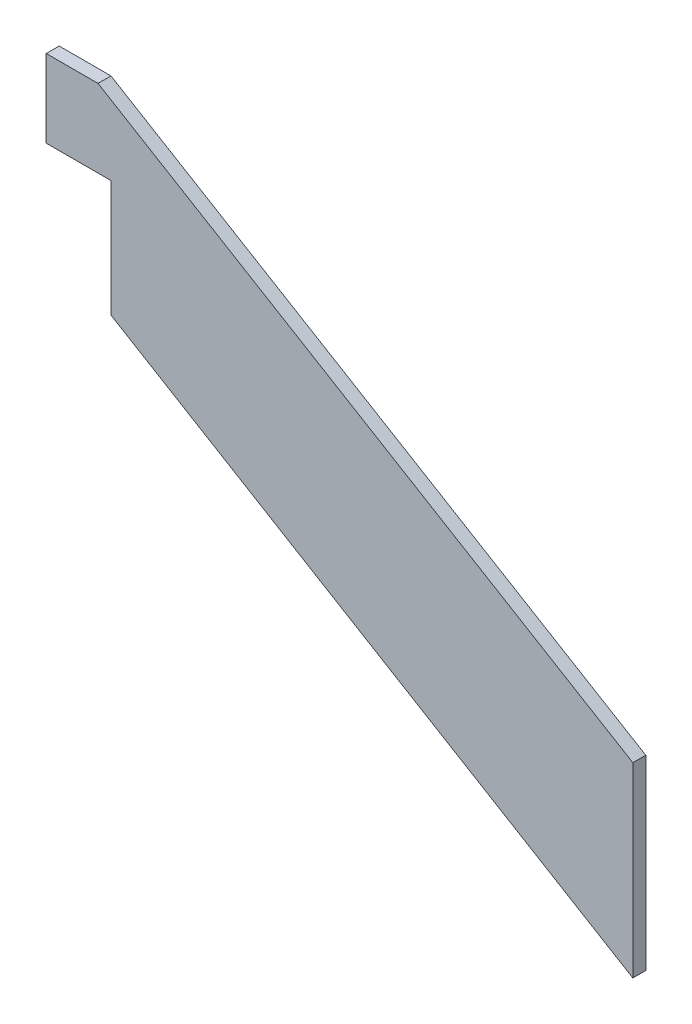
ISO-10303-21;
HEADER;
FILE_DESCRIPTION(('STEP AP214'),'2;1');
FILE_NAME('part.step','',(''),(''),'','','');
FILE_SCHEMA(('AUTOMOTIVE_DESIGN { 1 0 10303 214 1 1 1 1 }'));
ENDSEC;
DATA;
#1=APPLICATION_CONTEXT('core data for automotive mechanical design processes');
#2=APPLICATION_PROTOCOL_DEFINITION('international standard','automotive_design',2000,#1);
#3=PRODUCT_CONTEXT('',#1,'mechanical');
#4=PRODUCT('Part','Part','',(#3));
#5=PRODUCT_RELATED_PRODUCT_CATEGORY('part','',(#4));
#6=PRODUCT_DEFINITION_FORMATION('','',#4);
#7=PRODUCT_DEFINITION_CONTEXT('part definition',#1,'design');
#8=PRODUCT_DEFINITION('design','',#6,#7);
#9=PRODUCT_DEFINITION_SHAPE('','',#8);
#10=(LENGTH_UNIT() NAMED_UNIT(*) SI_UNIT(.MILLI.,.METRE.));
#11=(NAMED_UNIT(*) PLANE_ANGLE_UNIT() SI_UNIT($,.RADIAN.));
#12=(NAMED_UNIT(*) SI_UNIT($,.STERADIAN.) SOLID_ANGLE_UNIT());
#13=UNCERTAINTY_MEASURE_WITH_UNIT(LENGTH_MEASURE(1.E-05),#10,'distance_accuracy_value','');
#14=(GEOMETRIC_REPRESENTATION_CONTEXT(3) GLOBAL_UNCERTAINTY_ASSIGNED_CONTEXT((#13)) GLOBAL_UNIT_ASSIGNED_CONTEXT((#10,
#11,#12)) REPRESENTATION_CONTEXT('',''));
#15=CARTESIAN_POINT('',(0.,0.,0.));
#16=DIRECTION('',(0.,0.,1.));
#17=DIRECTION('',(1.,0.,0.));
#18=AXIS2_PLACEMENT_3D('',#15,#16,#17);
#19=CARTESIAN_POINT('',(0.,14.4,1.));
#20=DIRECTION('',(-1.,0.,0.));
#21=DIRECTION('',(0.,0.,1.));
#22=AXIS2_PLACEMENT_3D('',#19,#20,#21);
#23=PLANE('',#22);
#24=DIRECTION('',(0.,1.,0.));
#25=VECTOR('',#24,1.);
#26=CARTESIAN_POINT('',(0.,14.4,0.));
#27=LINE('',#26,#25);
#28=CARTESIAN_POINT('',(0.,0.,0.));
#29=VERTEX_POINT('',#28);
#30=CARTESIAN_POINT('',(0.,14.4,0.));
#31=VERTEX_POINT('',#30);
#32=EDGE_CURVE('E125',#29,#31,#27,.T.);
#33=ORIENTED_EDGE('',*,*,#32,.T.);
#34=DIRECTION('',(0.,0.,-1.));
#35=VECTOR('',#34,1.);
#36=CARTESIAN_POINT('',(0.,14.4,1.));
#37=LINE('',#36,#35);
#38=CARTESIAN_POINT('',(0.,14.4,1.));
#39=VERTEX_POINT('',#38);
#40=EDGE_CURVE('E11',#39,#31,#37,.T.);
#41=ORIENTED_EDGE('',*,*,#40,.F.);
#42=DIRECTION('',(0.,1.,0.));
#43=VECTOR('',#42,1.);
#44=CARTESIAN_POINT('',(0.,14.4,1.));
#45=LINE('',#44,#43);
#46=CARTESIAN_POINT('',(0.,0.,1.));
#47=VERTEX_POINT('',#46);
#48=EDGE_CURVE('E137',#47,#39,#45,.T.);
#49=ORIENTED_EDGE('',*,*,#48,.F.);
#50=DIRECTION('',(0.,0.,-1.));
#51=VECTOR('',#50,1.);
#52=CARTESIAN_POINT('',(0.,0.,1.));
#53=LINE('',#52,#51);
#54=EDGE_CURVE('E121',#47,#29,#53,.T.);
#55=ORIENTED_EDGE('',*,*,#54,.T.);
#56=EDGE_LOOP('',(#33,#41,#49,#55));
#57=FACE_BOUND('',#56,.T.);
#58=ADVANCED_FACE('F35',(#57),#23,.F.);
#59=CARTESIAN_POINT('',(-41.3021675084895,39.1813005050939,1.));
#60=DIRECTION('',(-0.51449575542753,-0.857492925712542,0.));
#61=DIRECTION('',(0.857492925712542,-0.51449575542753,0.));
#62=AXIS2_PLACEMENT_3D('',#59,#60,#61);
#63=PLANE('',#62);
#64=DIRECTION('',(-0.857492925712542,0.51449575542753,0.));
#65=VECTOR('',#64,1.);
#66=CARTESIAN_POINT('',(-41.3021675084895,39.1813005050939,0.));
#67=LINE('',#66,#65);
#68=CARTESIAN_POINT('',(-41.3021675084895,39.1813005050939,0.));
#69=VERTEX_POINT('',#68);
#70=EDGE_CURVE('E128',#31,#69,#67,.T.);
#71=ORIENTED_EDGE('',*,*,#70,.T.);
#72=DIRECTION('',(0.,0.,-1.));
#73=VECTOR('',#72,1.);
#74=CARTESIAN_POINT('',(-41.3021675084895,39.1813005050939,1.));
#75=LINE('',#74,#73);
#76=CARTESIAN_POINT('',(-41.3021675084895,39.1813005050939,1.));
#77=VERTEX_POINT('',#76);
#78=EDGE_CURVE('E43',#77,#69,#75,.T.);
#79=ORIENTED_EDGE('',*,*,#78,.F.);
#80=DIRECTION('',(-0.857492925712542,0.51449575542753,0.));
#81=VECTOR('',#80,1.);
#82=CARTESIAN_POINT('',(-41.3021675084895,39.1813005050939,1.));
#83=LINE('',#82,#81);
#84=EDGE_CURVE('E91',#39,#77,#83,.T.);
#85=ORIENTED_EDGE('',*,*,#84,.F.);
#86=ORIENTED_EDGE('',*,*,#40,.T.);
#87=EDGE_LOOP('',(#71,#79,#85,#86));
#88=FACE_BOUND('',#87,.T.);
#89=ADVANCED_FACE('F162',(#88),#63,.F.);
#90=CARTESIAN_POINT('',(-45.3021675084895,39.1813005050939,1.));
#91=DIRECTION('',(0.,-1.,0.));
#92=DIRECTION('',(0.,0.,-1.));
#93=AXIS2_PLACEMENT_3D('',#90,#91,#92);
#94=PLANE('',#93);
#95=DIRECTION('',(-1.,0.,0.));
#96=VECTOR('',#95,1.);
#97=CARTESIAN_POINT('',(-45.3021675084895,39.1813005050939,0.));
#98=LINE('',#97,#96);
#99=CARTESIAN_POINT('',(-45.3021675084895,39.1813005050939,0.));
#100=VERTEX_POINT('',#99);
#101=EDGE_CURVE('E130',#69,#100,#98,.T.);
#102=ORIENTED_EDGE('',*,*,#101,.T.);
#103=DIRECTION('',(0.,0.,-1.));
#104=VECTOR('',#103,1.);
#105=CARTESIAN_POINT('',(-45.3021675084895,39.1813005050939,1.));
#106=LINE('',#105,#104);
#107=CARTESIAN_POINT('',(-45.3021675084895,39.1813005050939,1.));
#108=VERTEX_POINT('',#107);
#109=EDGE_CURVE('E141',#108,#100,#106,.T.);
#110=ORIENTED_EDGE('',*,*,#109,.F.);
#111=DIRECTION('',(-1.,0.,0.));
#112=VECTOR('',#111,1.);
#113=CARTESIAN_POINT('',(-45.3021675084895,39.1813005050939,1.));
#114=LINE('',#113,#112);
#115=EDGE_CURVE('E149',#77,#108,#114,.T.);
#116=ORIENTED_EDGE('',*,*,#115,.F.);
#117=ORIENTED_EDGE('',*,*,#78,.T.);
#118=EDGE_LOOP('',(#102,#110,#116,#117));
#119=FACE_BOUND('',#118,.T.);
#120=ADVANCED_FACE('F147',(#119),#94,.F.);
#121=CARTESIAN_POINT('',(-45.3021675084895,33.1813005050939,1.));
#122=DIRECTION('',(1.,0.,0.));
#123=DIRECTION('',(0.,0.,-1.));
#124=AXIS2_PLACEMENT_3D('',#121,#122,#123);
#125=PLANE('',#124);
#126=DIRECTION('',(0.,-1.,0.));
#127=VECTOR('',#126,1.);
#128=CARTESIAN_POINT('',(-45.3021675084895,33.1813005050939,0.));
#129=LINE('',#128,#127);
#130=CARTESIAN_POINT('',(-45.3021675084895,33.1813005050939,0.));
#131=VERTEX_POINT('',#130);
#132=EDGE_CURVE('E132',#100,#131,#129,.T.);
#133=ORIENTED_EDGE('',*,*,#132,.T.);
#134=DIRECTION('',(0.,0.,-1.));
#135=VECTOR('',#134,1.);
#136=CARTESIAN_POINT('',(-45.3021675084895,33.1813005050939,1.));
#137=LINE('',#136,#135);
#138=CARTESIAN_POINT('',(-45.3021675084895,33.1813005050939,1.));
#139=VERTEX_POINT('',#138);
#140=EDGE_CURVE('E116',#139,#131,#137,.T.);
#141=ORIENTED_EDGE('',*,*,#140,.F.);
#142=DIRECTION('',(0.,-1.,0.));
#143=VECTOR('',#142,1.);
#144=CARTESIAN_POINT('',(-45.3021675084895,33.1813005050939,1.));
#145=LINE('',#144,#143);
#146=EDGE_CURVE('E107',#108,#139,#145,.T.);
#147=ORIENTED_EDGE('',*,*,#146,.F.);
#148=ORIENTED_EDGE('',*,*,#109,.T.);
#149=EDGE_LOOP('',(#133,#141,#147,#148));
#150=FACE_BOUND('',#149,.T.);
#151=ADVANCED_FACE('F155',(#150),#125,.F.);
#152=CARTESIAN_POINT('',(-40.3021675084895,33.1813005050939,1.));
#153=DIRECTION('',(0.,1.,0.));
#154=DIRECTION('',(0.,0.,1.));
#155=AXIS2_PLACEMENT_3D('',#152,#153,#154);
#156=PLANE('',#155);
#157=DIRECTION('',(1.,0.,0.));
#158=VECTOR('',#157,1.);
#159=CARTESIAN_POINT('',(-40.3021675084895,33.1813005050939,0.));
#160=LINE('',#159,#158);
#161=CARTESIAN_POINT('',(-40.3021675084895,33.1813005050939,0.));
#162=VERTEX_POINT('',#161);
#163=EDGE_CURVE('E115',#131,#162,#160,.T.);
#164=ORIENTED_EDGE('',*,*,#163,.T.);
#165=DIRECTION('',(0.,0.,-1.));
#166=VECTOR('',#165,1.);
#167=CARTESIAN_POINT('',(-40.3021675084895,33.1813005050939,1.));
#168=LINE('',#167,#166);
#169=CARTESIAN_POINT('',(-40.3021675084895,33.1813005050939,1.));
#170=VERTEX_POINT('',#169);
#171=EDGE_CURVE('E112',#170,#162,#168,.T.);
#172=ORIENTED_EDGE('',*,*,#171,.F.);
#173=DIRECTION('',(1.,0.,0.));
#174=VECTOR('',#173,1.);
#175=CARTESIAN_POINT('',(-40.3021675084895,33.1813005050939,1.));
#176=LINE('',#175,#174);
#177=EDGE_CURVE('E101',#139,#170,#176,.T.);
#178=ORIENTED_EDGE('',*,*,#177,.F.);
#179=ORIENTED_EDGE('',*,*,#140,.T.);
#180=EDGE_LOOP('',(#164,#172,#178,#179));
#181=FACE_BOUND('',#180,.T.);
#182=ADVANCED_FACE('F113',(#181),#156,.F.);
#183=CARTESIAN_POINT('',(-40.3021675084895,24.1813005050939,1.));
#184=DIRECTION('',(1.,0.,0.));
#185=DIRECTION('',(0.,0.,-1.));
#186=AXIS2_PLACEMENT_3D('',#183,#184,#185);
#187=PLANE('',#186);
#188=DIRECTION('',(0.,-1.,0.));
#189=VECTOR('',#188,1.);
#190=CARTESIAN_POINT('',(-40.3021675084895,24.1813005050939,0.));
#191=LINE('',#190,#189);
#192=CARTESIAN_POINT('',(-40.3021675084895,24.1813005050939,0.));
#193=VERTEX_POINT('',#192);
#194=EDGE_CURVE('E77',#162,#193,#191,.T.);
#195=ORIENTED_EDGE('',*,*,#194,.T.);
#196=DIRECTION('',(0.,0.,-1.));
#197=VECTOR('',#196,1.);
#198=CARTESIAN_POINT('',(-40.3021675084895,24.1813005050939,1.));
#199=LINE('',#198,#197);
#200=CARTESIAN_POINT('',(-40.3021675084895,24.1813005050939,1.));
#201=VERTEX_POINT('',#200);
#202=EDGE_CURVE('E117',#201,#193,#199,.T.);
#203=ORIENTED_EDGE('',*,*,#202,.F.);
#204=DIRECTION('',(0.,-1.,0.));
#205=VECTOR('',#204,1.);
#206=CARTESIAN_POINT('',(-40.3021675084895,24.1813005050939,1.));
#207=LINE('',#206,#205);
#208=EDGE_CURVE('E105',#170,#201,#207,.T.);
#209=ORIENTED_EDGE('',*,*,#208,.F.);
#210=ORIENTED_EDGE('',*,*,#171,.T.);
#211=EDGE_LOOP('',(#195,#203,#209,#210));
#212=FACE_BOUND('',#211,.T.);
#213=ADVANCED_FACE('F119',(#212),#187,.F.);
#214=CARTESIAN_POINT('',(0.,0.,1.));
#215=DIRECTION('',(0.51449575542753,0.857492925712542,0.));
#216=DIRECTION('',(-0.857492925712542,0.51449575542753,0.));
#217=AXIS2_PLACEMENT_3D('',#214,#215,#216);
#218=PLANE('',#217);
#219=DIRECTION('',(0.857492925712542,-0.51449575542753,0.));
#220=VECTOR('',#219,1.);
#221=CARTESIAN_POINT('',(0.,0.,0.));
#222=LINE('',#221,#220);
#223=EDGE_CURVE('E83',#193,#29,#222,.T.);
#224=ORIENTED_EDGE('',*,*,#223,.T.);
#225=ORIENTED_EDGE('',*,*,#54,.F.);
#226=DIRECTION('',(0.857492925712542,-0.51449575542753,0.));
#227=VECTOR('',#226,1.);
#228=CARTESIAN_POINT('',(0.,0.,1.));
#229=LINE('',#228,#227);
#230=EDGE_CURVE('E51',#201,#47,#229,.T.);
#231=ORIENTED_EDGE('',*,*,#230,.F.);
#232=ORIENTED_EDGE('',*,*,#202,.T.);
#233=EDGE_LOOP('',(#224,#225,#231,#232));
#234=FACE_BOUND('',#233,.T.);
#235=ADVANCED_FACE('F176',(#234),#218,.F.);
#236=CARTESIAN_POINT('',(0.,0.,1.));
#237=DIRECTION('',(0.,0.,-1.));
#238=DIRECTION('',(-1.,0.,0.));
#239=AXIS2_PLACEMENT_3D('',#236,#237,#238);
#240=PLANE('',#239);
#241=ORIENTED_EDGE('',*,*,#48,.T.);
#242=ORIENTED_EDGE('',*,*,#84,.T.);
#243=ORIENTED_EDGE('',*,*,#115,.T.);
#244=ORIENTED_EDGE('',*,*,#146,.T.);
#245=ORIENTED_EDGE('',*,*,#177,.T.);
#246=ORIENTED_EDGE('',*,*,#208,.T.);
#247=ORIENTED_EDGE('',*,*,#230,.T.);
#248=EDGE_LOOP('',(#241,#242,#243,#244,#245,#246,#247));
#249=FACE_BOUND('',#248,.T.);
#250=ADVANCED_FACE('F103',(#249),#240,.F.);
#251=CARTESIAN_POINT('',(0.,0.,0.));
#252=DIRECTION('',(0.,0.,-1.));
#253=DIRECTION('',(-1.,0.,0.));
#254=AXIS2_PLACEMENT_3D('',#251,#252,#253);
#255=PLANE('',#254);
#256=ORIENTED_EDGE('',*,*,#32,.F.);
#257=ORIENTED_EDGE('',*,*,#223,.F.);
#258=ORIENTED_EDGE('',*,*,#194,.F.);
#259=ORIENTED_EDGE('',*,*,#163,.F.);
#260=ORIENTED_EDGE('',*,*,#132,.F.);
#261=ORIENTED_EDGE('',*,*,#101,.F.);
#262=ORIENTED_EDGE('',*,*,#70,.F.);
#263=EDGE_LOOP('',(#256,#257,#258,#259,#260,#261,#262));
#264=FACE_BOUND('',#263,.T.);
#265=ADVANCED_FACE('F153',(#264),#255,.T.);
#266=CLOSED_SHELL('',(#58,#89,#120,#151,#182,#213,#235,#250,#265));
#267=MANIFOLD_SOLID_BREP('B2',#266);
#268=ADVANCED_BREP_SHAPE_REPRESENTATION('',(#18,#267),#14);
#269=SHAPE_DEFINITION_REPRESENTATION(#9,#268);
ENDSEC;
END-ISO-10303-21;
